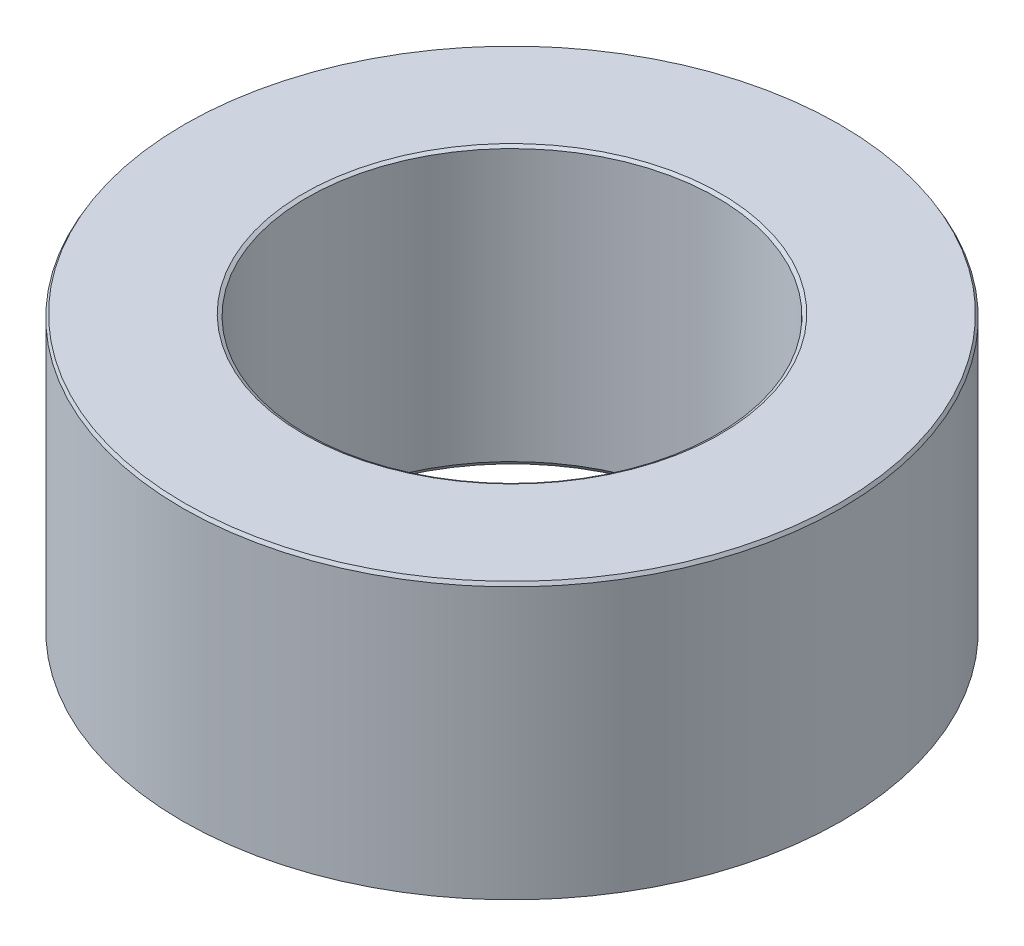
ISO-10303-21;
HEADER;
FILE_DESCRIPTION(('STEP AP214'),'2;1');
FILE_NAME('part.step','',(''),(''),'','','');
FILE_SCHEMA(('AUTOMOTIVE_DESIGN { 1 0 10303 214 1 1 1 1 }'));
ENDSEC;
DATA;
#1=APPLICATION_CONTEXT('core data for automotive mechanical design processes');
#2=APPLICATION_PROTOCOL_DEFINITION('international standard','automotive_design',2000,#1);
#3=PRODUCT_CONTEXT('',#1,'mechanical');
#4=PRODUCT('Part','Part','',(#3));
#5=PRODUCT_RELATED_PRODUCT_CATEGORY('part','',(#4));
#6=PRODUCT_DEFINITION_FORMATION('','',#4);
#7=PRODUCT_DEFINITION_CONTEXT('part definition',#1,'design');
#8=PRODUCT_DEFINITION('design','',#6,#7);
#9=PRODUCT_DEFINITION_SHAPE('','',#8);
#10=(LENGTH_UNIT() NAMED_UNIT(*) SI_UNIT(.MILLI.,.METRE.));
#11=(NAMED_UNIT(*) PLANE_ANGLE_UNIT() SI_UNIT($,.RADIAN.));
#12=(NAMED_UNIT(*) SI_UNIT($,.STERADIAN.) SOLID_ANGLE_UNIT());
#13=UNCERTAINTY_MEASURE_WITH_UNIT(LENGTH_MEASURE(1.E-05),#10,'distance_accuracy_value','');
#14=(GEOMETRIC_REPRESENTATION_CONTEXT(3) GLOBAL_UNCERTAINTY_ASSIGNED_CONTEXT((#13)) GLOBAL_UNIT_ASSIGNED_CONTEXT((#10,
#11,#12)) REPRESENTATION_CONTEXT('',''));
#15=CARTESIAN_POINT('',(0.,0.,0.));
#16=DIRECTION('',(0.,0.,1.));
#17=DIRECTION('',(1.,0.,0.));
#18=AXIS2_PLACEMENT_3D('',#15,#16,#17);
#19=CARTESIAN_POINT('',(0.,31.4396491560367,0.));
#20=DIRECTION('',(0.,-1.,0.));
#21=DIRECTION('',(0.,0.,-1.));
#22=AXIS2_PLACEMENT_3D('',#19,#20,#21);
#23=CYLINDRICAL_SURFACE('',#22,37.5);
#24=CARTESIAN_POINT('',(0.,0.222650482181348,0.));
#25=DIRECTION('',(0.,1.,0.));
#26=DIRECTION('',(0.,0.,1.));
#27=AXIS2_PLACEMENT_3D('',#24,#25,#26);
#28=CIRCLE('',#27,37.5);
#29=CARTESIAN_POINT('',(0.,0.222650482181348,37.5));
#30=VERTEX_POINT('',#29);
#31=EDGE_CURVE('E10',#30,#30,#28,.T.);
#32=ORIENTED_EDGE('',*,*,#31,.T.);
#33=EDGE_LOOP('',(#32));
#34=FACE_BOUND('',#33,.T.);
#35=CARTESIAN_POINT('',(0.,31.0540072085688,0.));
#36=DIRECTION('',(0.,1.,0.));
#37=DIRECTION('',(0.,0.,1.));
#38=AXIS2_PLACEMENT_3D('',#35,#36,#37);
#39=CIRCLE('',#38,37.5);
#40=CARTESIAN_POINT('',(0.,31.0540072085688,37.5));
#41=VERTEX_POINT('',#40);
#42=EDGE_CURVE('E50',#41,#41,#39,.F.);
#43=ORIENTED_EDGE('',*,*,#42,.T.);
#44=EDGE_LOOP('',(#43));
#45=FACE_BOUND('',#44,.T.);
#46=ADVANCED_FACE('F39',(#34,#45),#23,.T.);
#47=CARTESIAN_POINT('',(0.,31.4396491560367,0.));
#48=DIRECTION('',(0.,1.,0.));
#49=DIRECTION('',(0.,0.,1.));
#50=AXIS2_PLACEMENT_3D('',#47,#48,#49);
#51=PLANE('',#50);
#52=CARTESIAN_POINT('',(0.,31.4396491560367,0.));
#53=DIRECTION('',(0.,1.,0.));
#54=DIRECTION('',(0.,0.,1.));
#55=AXIS2_PLACEMENT_3D('',#52,#53,#54);
#56=CIRCLE('',#55,23.7099238939448);
#57=CARTESIAN_POINT('',(0.,31.4396491560367,23.7099238939448));
#58=VERTEX_POINT('',#57);
#59=EDGE_CURVE('E58',#58,#58,#56,.F.);
#60=ORIENTED_EDGE('',*,*,#59,.T.);
#61=EDGE_LOOP('',(#60));
#62=FACE_BOUND('',#61,.T.);
#63=CARTESIAN_POINT('',(0.,31.4396491560367,0.));
#64=DIRECTION('',(0.,1.,0.));
#65=DIRECTION('',(0.,0.,1.));
#66=AXIS2_PLACEMENT_3D('',#63,#64,#65);
#67=CIRCLE('',#66,37.2773495178186);
#68=CARTESIAN_POINT('',(0.,31.4396491560367,37.2773495178186));
#69=VERTEX_POINT('',#68);
#70=EDGE_CURVE('E61',#69,#69,#67,.T.);
#71=ORIENTED_EDGE('',*,*,#70,.T.);
#72=EDGE_LOOP('',(#71));
#73=FACE_BOUND('',#72,.T.);
#74=ADVANCED_FACE('F88',(#62,#73),#51,.T.);
#75=CARTESIAN_POINT('',(0.,0.,0.));
#76=DIRECTION('',(0.,1.,0.));
#77=DIRECTION('',(0.,0.,1.));
#78=AXIS2_PLACEMENT_3D('',#75,#76,#77);
#79=PLANE('',#78);
#80=CARTESIAN_POINT('',(0.,0.,0.));
#81=DIRECTION('',(0.,1.,0.));
#82=DIRECTION('',(0.,0.,1.));
#83=AXIS2_PLACEMENT_3D('',#80,#81,#82);
#84=CIRCLE('',#83,23.5469324286584);
#85=CARTESIAN_POINT('',(0.,0.,23.5469324286584));
#86=VERTEX_POINT('',#85);
#87=EDGE_CURVE('E51',#86,#86,#84,.T.);
#88=ORIENTED_EDGE('',*,*,#87,.T.);
#89=EDGE_LOOP('',(#88));
#90=FACE_BOUND('',#89,.T.);
#91=CARTESIAN_POINT('',(0.,0.,0.));
#92=DIRECTION('',(0.,1.,0.));
#93=DIRECTION('',(0.,0.,1.));
#94=AXIS2_PLACEMENT_3D('',#91,#92,#93);
#95=CIRCLE('',#94,37.1143580525322);
#96=CARTESIAN_POINT('',(0.,0.,37.1143580525322));
#97=VERTEX_POINT('',#96);
#98=EDGE_CURVE('E54',#97,#97,#95,.F.);
#99=ORIENTED_EDGE('',*,*,#98,.T.);
#100=EDGE_LOOP('',(#99));
#101=FACE_BOUND('',#100,.T.);
#102=ADVANCED_FACE('F83',(#90,#101),#79,.F.);
#103=CARTESIAN_POINT('',(0.,31.4396491560367,0.));
#104=DIRECTION('',(0.,-1.,0.));
#105=DIRECTION('',(0.,0.,-1.));
#106=AXIS2_PLACEMENT_3D('',#103,#104,#105);
#107=CYLINDRICAL_SURFACE('',#106,23.324281946477);
#108=CARTESIAN_POINT('',(0.,31.2169986738553,0.));
#109=DIRECTION('',(0.,1.,0.));
#110=DIRECTION('',(0.,0.,1.));
#111=AXIS2_PLACEMENT_3D('',#108,#109,#110);
#112=CIRCLE('',#111,23.324281946477);
#113=CARTESIAN_POINT('',(0.,31.2169986738553,23.324281946477));
#114=VERTEX_POINT('',#113);
#115=EDGE_CURVE('E67',#114,#114,#112,.T.);
#116=ORIENTED_EDGE('',*,*,#115,.T.);
#117=EDGE_LOOP('',(#116));
#118=FACE_BOUND('',#117,.T.);
#119=CARTESIAN_POINT('',(0.,0.385641947467846,0.));
#120=DIRECTION('',(0.,1.,0.));
#121=DIRECTION('',(0.,0.,1.));
#122=AXIS2_PLACEMENT_3D('',#119,#120,#121);
#123=CIRCLE('',#122,23.324281946477);
#124=CARTESIAN_POINT('',(0.,0.385641947467846,23.324281946477));
#125=VERTEX_POINT('',#124);
#126=EDGE_CURVE('E69',#125,#125,#123,.F.);
#127=ORIENTED_EDGE('',*,*,#126,.T.);
#128=EDGE_LOOP('',(#127));
#129=FACE_BOUND('',#128,.T.);
#130=ADVANCED_FACE('F71',(#118,#129),#107,.F.);
#131=CARTESIAN_POINT('',(0.,31.2169986738553,0.));
#132=DIRECTION('',(0.,1.,0.));
#133=DIRECTION('',(0.,0.,1.));
#134=AXIS2_PLACEMENT_3D('',#131,#132,#133);
#135=CONICAL_SURFACE('',#134,23.324281946477,1.04719755119659);
#136=ORIENTED_EDGE('',*,*,#59,.F.);
#137=EDGE_LOOP('',(#136));
#138=FACE_BOUND('',#137,.T.);
#139=ORIENTED_EDGE('',*,*,#115,.F.);
#140=EDGE_LOOP('',(#139));
#141=FACE_BOUND('',#140,.T.);
#142=ADVANCED_FACE('F77',(#138,#141),#135,.F.);
#143=CARTESIAN_POINT('',(0.,0.,0.));
#144=DIRECTION('',(0.,-1.,0.));
#145=DIRECTION('',(0.,0.,-1.));
#146=AXIS2_PLACEMENT_3D('',#143,#144,#145);
#147=CONICAL_SURFACE('',#146,23.5469324286584,0.523598775598305);
#148=ORIENTED_EDGE('',*,*,#126,.F.);
#149=EDGE_LOOP('',(#148));
#150=FACE_BOUND('',#149,.T.);
#151=ORIENTED_EDGE('',*,*,#87,.F.);
#152=EDGE_LOOP('',(#151));
#153=FACE_BOUND('',#152,.T.);
#154=ADVANCED_FACE('F73',(#150,#153),#147,.F.);
#155=CARTESIAN_POINT('',(0.,0.222650482181348,0.));
#156=DIRECTION('',(0.,1.,0.));
#157=DIRECTION('',(0.,0.,1.));
#158=AXIS2_PLACEMENT_3D('',#155,#156,#157);
#159=CONICAL_SURFACE('',#158,37.5,1.04719755119659);
#160=ORIENTED_EDGE('',*,*,#98,.F.);
#161=EDGE_LOOP('',(#160));
#162=FACE_BOUND('',#161,.T.);
#163=ORIENTED_EDGE('',*,*,#31,.F.);
#164=EDGE_LOOP('',(#163));
#165=FACE_BOUND('',#164,.T.);
#166=ADVANCED_FACE('F76',(#162,#165),#159,.T.);
#167=CARTESIAN_POINT('',(0.,31.4396491560367,0.));
#168=DIRECTION('',(0.,-1.,0.));
#169=DIRECTION('',(0.,0.,-1.));
#170=AXIS2_PLACEMENT_3D('',#167,#168,#169);
#171=CONICAL_SURFACE('',#170,37.2773495178186,0.523598775598317);
#172=ORIENTED_EDGE('',*,*,#42,.F.);
#173=EDGE_LOOP('',(#172));
#174=FACE_BOUND('',#173,.T.);
#175=ORIENTED_EDGE('',*,*,#70,.F.);
#176=EDGE_LOOP('',(#175));
#177=FACE_BOUND('',#176,.T.);
#178=ADVANCED_FACE('F45',(#174,#177),#171,.T.);
#179=CLOSED_SHELL('',(#46,#74,#102,#130,#142,#154,#166,#178));
#180=MANIFOLD_SOLID_BREP('B2',#179);
#181=ADVANCED_BREP_SHAPE_REPRESENTATION('',(#18,#180),#14);
#182=SHAPE_DEFINITION_REPRESENTATION(#9,#181);
ENDSEC;
END-ISO-10303-21;
